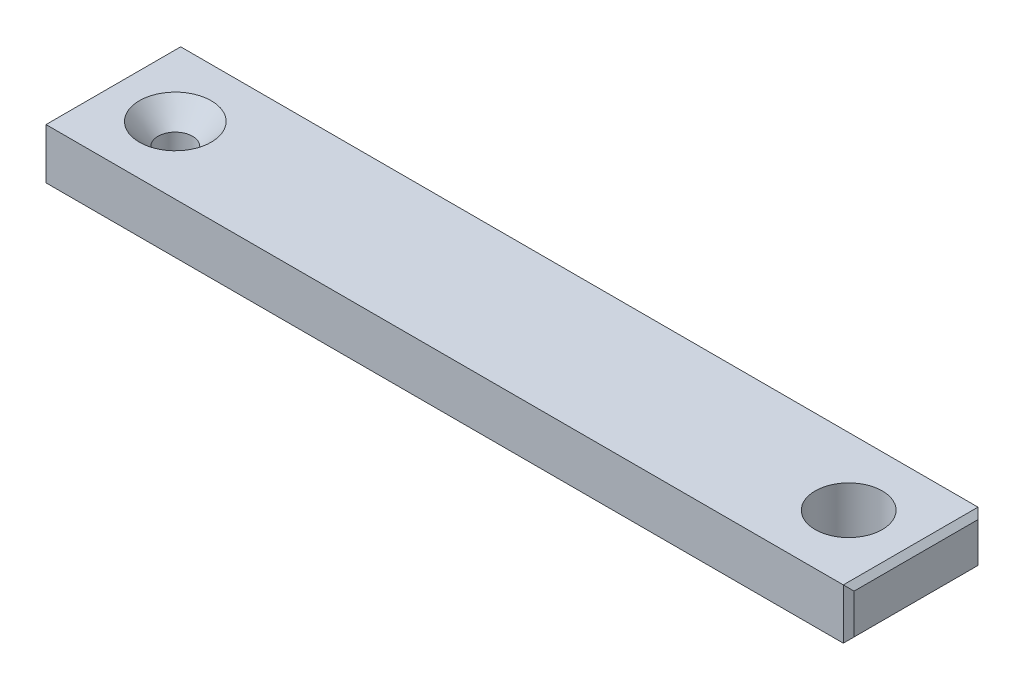
ISO-10303-21;
HEADER;
FILE_DESCRIPTION(('STEP AP214'),'2;1');
FILE_NAME('part.step','',(''),(''),'','','');
FILE_SCHEMA(('AUTOMOTIVE_DESIGN { 1 0 10303 214 1 1 1 1 }'));
ENDSEC;
DATA;
#1=APPLICATION_CONTEXT('core data for automotive mechanical design processes');
#2=APPLICATION_PROTOCOL_DEFINITION('international standard','automotive_design',2000,#1);
#3=PRODUCT_CONTEXT('',#1,'mechanical');
#4=PRODUCT('Part','Part','',(#3));
#5=PRODUCT_RELATED_PRODUCT_CATEGORY('part','',(#4));
#6=PRODUCT_DEFINITION_FORMATION('','',#4);
#7=PRODUCT_DEFINITION_CONTEXT('part definition',#1,'design');
#8=PRODUCT_DEFINITION('design','',#6,#7);
#9=PRODUCT_DEFINITION_SHAPE('','',#8);
#10=(LENGTH_UNIT() NAMED_UNIT(*) SI_UNIT(.MILLI.,.METRE.));
#11=(NAMED_UNIT(*) PLANE_ANGLE_UNIT() SI_UNIT($,.RADIAN.));
#12=(NAMED_UNIT(*) SI_UNIT($,.STERADIAN.) SOLID_ANGLE_UNIT());
#13=UNCERTAINTY_MEASURE_WITH_UNIT(LENGTH_MEASURE(1.E-05),#10,'distance_accuracy_value','');
#14=(GEOMETRIC_REPRESENTATION_CONTEXT(3) GLOBAL_UNCERTAINTY_ASSIGNED_CONTEXT((#13)) GLOBAL_UNIT_ASSIGNED_CONTEXT((#10,
#11,#12)) REPRESENTATION_CONTEXT('',''));
#15=CARTESIAN_POINT('',(0.,0.,0.));
#16=DIRECTION('',(0.,0.,1.));
#17=DIRECTION('',(1.,0.,0.));
#18=AXIS2_PLACEMENT_3D('',#15,#16,#17);
#19=CARTESIAN_POINT('',(0.,4.7625,6.35));
#20=DIRECTION('',(0.,0.,-1.));
#21=DIRECTION('',(-1.,0.,0.));
#22=AXIS2_PLACEMENT_3D('',#19,#20,#21);
#23=PLANE('',#22);
#24=DIRECTION('',(1.,0.,0.));
#25=VECTOR('',#24,1.);
#26=CARTESIAN_POINT('',(0.,4.7625,6.35));
#27=LINE('',#26,#25);
#28=CARTESIAN_POINT('',(-69.342,4.7625,6.35));
#29=VERTEX_POINT('',#28);
#30=CARTESIAN_POINT('',(5.84199999999999,4.7625,6.35));
#31=VERTEX_POINT('',#30);
#32=EDGE_CURVE('E182',#29,#31,#27,.T.);
#33=ORIENTED_EDGE('',*,*,#32,.F.);
#34=DIRECTION('',(0.,-1.,0.));
#35=VECTOR('',#34,1.);
#36=CARTESIAN_POINT('',(-69.342,4.7625,6.35));
#37=LINE('',#36,#35);
#38=CARTESIAN_POINT('',(-69.342,0.,6.35));
#39=VERTEX_POINT('',#38);
#40=EDGE_CURVE('E140',#29,#39,#37,.T.);
#41=ORIENTED_EDGE('',*,*,#40,.T.);
#42=DIRECTION('',(1.,0.,0.));
#43=VECTOR('',#42,1.);
#44=CARTESIAN_POINT('',(0.,0.,6.35));
#45=LINE('',#44,#43);
#46=CARTESIAN_POINT('',(5.84199999999999,0.,6.35));
#47=VERTEX_POINT('',#46);
#48=EDGE_CURVE('E183',#39,#47,#45,.T.);
#49=ORIENTED_EDGE('',*,*,#48,.T.);
#50=DIRECTION('',(0.,1.,0.));
#51=VECTOR('',#50,1.);
#52=CARTESIAN_POINT('',(5.84199999999999,4.7625,6.35));
#53=LINE('',#52,#51);
#54=EDGE_CURVE('E137',#47,#31,#53,.T.);
#55=ORIENTED_EDGE('',*,*,#54,.T.);
#56=EDGE_LOOP('',(#33,#41,#49,#55));
#57=FACE_BOUND('',#56,.T.);
#58=ADVANCED_FACE('F35',(#57),#23,.F.);
#59=CARTESIAN_POINT('',(6.34999999999999,4.7625,0.));
#60=DIRECTION('',(1.,0.,0.));
#61=DIRECTION('',(0.,0.,-1.));
#62=AXIS2_PLACEMENT_3D('',#59,#60,#61);
#63=PLANE('',#62);
#64=DIRECTION('',(0.,0.,1.));
#65=VECTOR('',#64,1.);
#66=CARTESIAN_POINT('',(6.34999999999999,4.25449999999999,0.));
#67=LINE('',#66,#65);
#68=CARTESIAN_POINT('',(6.34999999999999,4.25449999999999,-5.84199999999999));
#69=VERTEX_POINT('',#68);
#70=CARTESIAN_POINT('',(6.34999999999999,4.25449999999999,5.84199999999999));
#71=VERTEX_POINT('',#70);
#72=EDGE_CURVE('E44',#69,#71,#67,.T.);
#73=ORIENTED_EDGE('',*,*,#72,.T.);
#74=DIRECTION('',(0.,-1.,0.));
#75=VECTOR('',#74,1.);
#76=CARTESIAN_POINT('',(6.34999999999999,0.,5.84199999999999));
#77=LINE('',#76,#75);
#78=CARTESIAN_POINT('',(6.34999999999999,0.508000000000008,5.84199999999999));
#79=VERTEX_POINT('',#78);
#80=EDGE_CURVE('E11',#71,#79,#77,.T.);
#81=ORIENTED_EDGE('',*,*,#80,.T.);
#82=DIRECTION('',(0.,0.,-1.));
#83=VECTOR('',#82,1.);
#84=CARTESIAN_POINT('',(6.34999999999999,0.508000000000008,-6.35));
#85=LINE('',#84,#83);
#86=CARTESIAN_POINT('',(6.34999999999999,0.508000000000008,-5.84199999999999));
#87=VERTEX_POINT('',#86);
#88=EDGE_CURVE('E146',#79,#87,#85,.T.);
#89=ORIENTED_EDGE('',*,*,#88,.T.);
#90=DIRECTION('',(0.,1.,0.));
#91=VECTOR('',#90,1.);
#92=CARTESIAN_POINT('',(6.34999999999999,4.7625,-5.84199999999999));
#93=LINE('',#92,#91);
#94=EDGE_CURVE('E55',#87,#69,#93,.T.);
#95=ORIENTED_EDGE('',*,*,#94,.T.);
#96=EDGE_LOOP('',(#73,#81,#89,#95));
#97=FACE_BOUND('',#96,.T.);
#98=ADVANCED_FACE('F240',(#97),#63,.T.);
#99=CARTESIAN_POINT('',(0.,4.7625,-6.35));
#100=DIRECTION('',(0.,0.,-1.));
#101=DIRECTION('',(-1.,0.,0.));
#102=AXIS2_PLACEMENT_3D('',#99,#100,#101);
#103=PLANE('',#102);
#104=DIRECTION('',(1.,0.,0.));
#105=VECTOR('',#104,1.);
#106=CARTESIAN_POINT('',(0.,0.,-6.35));
#107=LINE('',#106,#105);
#108=CARTESIAN_POINT('',(-69.342,0.,-6.35));
#109=VERTEX_POINT('',#108);
#110=CARTESIAN_POINT('',(5.84199999999999,0.,-6.35));
#111=VERTEX_POINT('',#110);
#112=EDGE_CURVE('E176',#109,#111,#107,.T.);
#113=ORIENTED_EDGE('',*,*,#112,.F.);
#114=DIRECTION('',(0.,1.,0.));
#115=VECTOR('',#114,1.);
#116=CARTESIAN_POINT('',(-69.342,4.7625,-6.35));
#117=LINE('',#116,#115);
#118=CARTESIAN_POINT('',(-69.342,4.7625,-6.35));
#119=VERTEX_POINT('',#118);
#120=EDGE_CURVE('E107',#109,#119,#117,.T.);
#121=ORIENTED_EDGE('',*,*,#120,.T.);
#122=DIRECTION('',(1.,0.,0.));
#123=VECTOR('',#122,1.);
#124=CARTESIAN_POINT('',(0.,4.7625,-6.35));
#125=LINE('',#124,#123);
#126=CARTESIAN_POINT('',(5.84199999999999,4.7625,-6.35));
#127=VERTEX_POINT('',#126);
#128=EDGE_CURVE('E120',#119,#127,#125,.T.);
#129=ORIENTED_EDGE('',*,*,#128,.T.);
#130=DIRECTION('',(0.,-1.,0.));
#131=VECTOR('',#130,1.);
#132=CARTESIAN_POINT('',(5.84199999999999,4.7625,-6.35));
#133=LINE('',#132,#131);
#134=EDGE_CURVE('E126',#127,#111,#133,.T.);
#135=ORIENTED_EDGE('',*,*,#134,.T.);
#136=EDGE_LOOP('',(#113,#121,#129,#135));
#137=FACE_BOUND('',#136,.T.);
#138=ADVANCED_FACE('F175',(#137),#103,.T.);
#139=CARTESIAN_POINT('',(-69.85,4.7625,0.));
#140=DIRECTION('',(1.,0.,0.));
#141=DIRECTION('',(0.,0.,-1.));
#142=AXIS2_PLACEMENT_3D('',#139,#140,#141);
#143=PLANE('',#142);
#144=DIRECTION('',(0.,0.,-1.));
#145=VECTOR('',#144,1.);
#146=CARTESIAN_POINT('',(-69.85,4.25450000000001,-6.35));
#147=LINE('',#146,#145);
#148=CARTESIAN_POINT('',(-69.85,4.25450000000001,5.84200000000001));
#149=VERTEX_POINT('',#148);
#150=CARTESIAN_POINT('',(-69.85,4.25450000000001,-5.84200000000001));
#151=VERTEX_POINT('',#150);
#152=EDGE_CURVE('E124',#149,#151,#147,.T.);
#153=ORIENTED_EDGE('',*,*,#152,.T.);
#154=DIRECTION('',(0.,-1.,0.));
#155=VECTOR('',#154,1.);
#156=CARTESIAN_POINT('',(-69.85,0.,-5.84200000000001));
#157=LINE('',#156,#155);
#158=CARTESIAN_POINT('',(-69.85,0.507999999999995,-5.84200000000001));
#159=VERTEX_POINT('',#158);
#160=EDGE_CURVE('E105',#151,#159,#157,.T.);
#161=ORIENTED_EDGE('',*,*,#160,.T.);
#162=DIRECTION('',(0.,0.,1.));
#163=VECTOR('',#162,1.);
#164=CARTESIAN_POINT('',(-69.85,0.507999999999995,0.));
#165=LINE('',#164,#163);
#166=CARTESIAN_POINT('',(-69.85,0.507999999999995,5.84200000000001));
#167=VERTEX_POINT('',#166);
#168=EDGE_CURVE('E113',#159,#167,#165,.T.);
#169=ORIENTED_EDGE('',*,*,#168,.T.);
#170=DIRECTION('',(0.,1.,0.));
#171=VECTOR('',#170,1.);
#172=CARTESIAN_POINT('',(-69.85,4.7625,5.84200000000001));
#173=LINE('',#172,#171);
#174=EDGE_CURVE('E119',#167,#149,#173,.T.);
#175=ORIENTED_EDGE('',*,*,#174,.T.);
#176=EDGE_LOOP('',(#153,#161,#169,#175));
#177=FACE_BOUND('',#176,.T.);
#178=ADVANCED_FACE('F122',(#177),#143,.F.);
#179=CARTESIAN_POINT('',(0.,4.7625,0.));
#180=DIRECTION('',(0.,1.,0.));
#181=DIRECTION('',(0.,0.,1.));
#182=AXIS2_PLACEMENT_3D('',#179,#180,#181);
#183=PLANE('',#182);
#184=CARTESIAN_POINT('',(0.,4.7625,0.));
#185=DIRECTION('',(0.,1.,0.));
#186=DIRECTION('',(0.,0.,1.));
#187=AXIS2_PLACEMENT_3D('',#184,#185,#186);
#188=CIRCLE('',#187,3.1623);
#189=CARTESIAN_POINT('',(0.,4.7625,3.1623));
#190=VERTEX_POINT('',#189);
#191=EDGE_CURVE('E155',#190,#190,#188,.T.);
#192=ORIENTED_EDGE('',*,*,#191,.F.);
#193=EDGE_LOOP('',(#192));
#194=FACE_BOUND('',#193,.T.);
#195=CARTESIAN_POINT('',(-63.5,4.7625,0.));
#196=DIRECTION('',(0.,1.,0.));
#197=DIRECTION('',(0.,0.,1.));
#198=AXIS2_PLACEMENT_3D('',#195,#196,#197);
#199=CIRCLE('',#198,3.3909);
#200=CARTESIAN_POINT('',(-63.5,4.7625,3.3909));
#201=VERTEX_POINT('',#200);
#202=EDGE_CURVE('E206',#201,#201,#199,.T.);
#203=ORIENTED_EDGE('',*,*,#202,.F.);
#204=EDGE_LOOP('',(#203));
#205=FACE_BOUND('',#204,.T.);
#206=ORIENTED_EDGE('',*,*,#128,.F.);
#207=DIRECTION('',(0.,0.,1.));
#208=VECTOR('',#207,1.);
#209=CARTESIAN_POINT('',(-69.342,4.7625,6.35));
#210=LINE('',#209,#208);
#211=EDGE_CURVE('E135',#119,#29,#210,.T.);
#212=ORIENTED_EDGE('',*,*,#211,.T.);
#213=ORIENTED_EDGE('',*,*,#32,.T.);
#214=DIRECTION('',(0.,0.,-1.));
#215=VECTOR('',#214,1.);
#216=CARTESIAN_POINT('',(5.84199999999999,4.7625,0.));
#217=LINE('',#216,#215);
#218=EDGE_CURVE('E133',#31,#127,#217,.T.);
#219=ORIENTED_EDGE('',*,*,#218,.T.);
#220=EDGE_LOOP('',(#206,#212,#213,#219));
#221=FACE_BOUND('',#220,.T.);
#222=ADVANCED_FACE('F199',(#194,#205,#221),#183,.T.);
#223=CARTESIAN_POINT('',(0.,0.,0.));
#224=DIRECTION('',(0.,1.,0.));
#225=DIRECTION('',(0.,0.,1.));
#226=AXIS2_PLACEMENT_3D('',#223,#224,#225);
#227=PLANE('',#226);
#228=CARTESIAN_POINT('',(0.,0.,0.));
#229=DIRECTION('',(0.,1.,0.));
#230=DIRECTION('',(0.,0.,1.));
#231=AXIS2_PLACEMENT_3D('',#228,#229,#230);
#232=CIRCLE('',#231,3.1623);
#233=CARTESIAN_POINT('',(0.,0.,3.1623));
#234=VERTEX_POINT('',#233);
#235=EDGE_CURVE('E209',#234,#234,#232,.T.);
#236=ORIENTED_EDGE('',*,*,#235,.T.);
#237=EDGE_LOOP('',(#236));
#238=FACE_BOUND('',#237,.T.);
#239=CARTESIAN_POINT('',(-63.5,0.,0.));
#240=DIRECTION('',(0.,1.,0.));
#241=DIRECTION('',(0.,0.,1.));
#242=AXIS2_PLACEMENT_3D('',#239,#240,#241);
#243=CIRCLE('',#242,1.63195);
#244=CARTESIAN_POINT('',(-63.5,0.,1.63195));
#245=VERTEX_POINT('',#244);
#246=EDGE_CURVE('E187',#245,#245,#243,.T.);
#247=ORIENTED_EDGE('',*,*,#246,.T.);
#248=EDGE_LOOP('',(#247));
#249=FACE_BOUND('',#248,.T.);
#250=ORIENTED_EDGE('',*,*,#48,.F.);
#251=DIRECTION('',(0.,0.,-1.));
#252=VECTOR('',#251,1.);
#253=CARTESIAN_POINT('',(-69.342,0.,0.));
#254=LINE('',#253,#252);
#255=EDGE_CURVE('E144',#39,#109,#254,.T.);
#256=ORIENTED_EDGE('',*,*,#255,.T.);
#257=ORIENTED_EDGE('',*,*,#112,.T.);
#258=DIRECTION('',(0.,0.,1.));
#259=VECTOR('',#258,1.);
#260=CARTESIAN_POINT('',(5.84199999999999,0.,6.35));
#261=LINE('',#260,#259);
#262=EDGE_CURVE('E142',#111,#47,#261,.T.);
#263=ORIENTED_EDGE('',*,*,#262,.T.);
#264=EDGE_LOOP('',(#250,#256,#257,#263));
#265=FACE_BOUND('',#264,.T.);
#266=ADVANCED_FACE('F180',(#238,#249,#265),#227,.F.);
#267=CARTESIAN_POINT('',(-63.5,4.7625,0.));
#268=DIRECTION('',(0.,1.,0.));
#269=DIRECTION('',(0.,0.,1.));
#270=AXIS2_PLACEMENT_3D('',#267,#268,#269);
#271=CYLINDRICAL_SURFACE('',#270,1.63195);
#272=ORIENTED_EDGE('',*,*,#246,.F.);
#273=EDGE_LOOP('',(#272));
#274=FACE_BOUND('',#273,.T.);
#275=CARTESIAN_POINT('',(-63.5,2.73905949011861,0.));
#276=DIRECTION('',(0.,1.,0.));
#277=DIRECTION('',(0.,0.,1.));
#278=AXIS2_PLACEMENT_3D('',#275,#276,#277);
#279=CIRCLE('',#278,1.63195);
#280=CARTESIAN_POINT('',(-63.5,2.73905949011861,1.63195));
#281=VERTEX_POINT('',#280);
#282=EDGE_CURVE('E203',#281,#281,#279,.T.);
#283=ORIENTED_EDGE('',*,*,#282,.T.);
#284=EDGE_LOOP('',(#283));
#285=FACE_BOUND('',#284,.T.);
#286=ADVANCED_FACE('F230',(#274,#285),#271,.F.);
#287=CARTESIAN_POINT('',(-63.5,4.7625,0.));
#288=DIRECTION('',(0.,1.,0.));
#289=DIRECTION('',(0.,0.,1.));
#290=AXIS2_PLACEMENT_3D('',#287,#288,#289);
#291=CONICAL_SURFACE('',#290,3.3909,0.715584993317676);
#292=ORIENTED_EDGE('',*,*,#282,.F.);
#293=EDGE_LOOP('',(#292));
#294=FACE_BOUND('',#293,.T.);
#295=ORIENTED_EDGE('',*,*,#202,.T.);
#296=EDGE_LOOP('',(#295));
#297=FACE_BOUND('',#296,.T.);
#298=ADVANCED_FACE('F220',(#294,#297),#291,.F.);
#299=CARTESIAN_POINT('',(0.,0.,0.));
#300=DIRECTION('',(0.,1.,0.));
#301=DIRECTION('',(0.,0.,1.));
#302=AXIS2_PLACEMENT_3D('',#299,#300,#301);
#303=CYLINDRICAL_SURFACE('',#302,3.1623);
#304=ORIENTED_EDGE('',*,*,#235,.F.);
#305=EDGE_LOOP('',(#304));
#306=FACE_BOUND('',#305,.T.);
#307=ORIENTED_EDGE('',*,*,#191,.T.);
#308=EDGE_LOOP('',(#307));
#309=FACE_BOUND('',#308,.T.);
#310=ADVANCED_FACE('F217',(#306,#309),#303,.F.);
#311=CARTESIAN_POINT('',(-69.342,4.7625,6.35));
#312=DIRECTION('',(0.707106781186538,0.,-0.707106781186557));
#313=DIRECTION('',(0.,-1.,0.));
#314=AXIS2_PLACEMENT_3D('',#311,#312,#313);
#315=PLANE('',#314);
#316=DIRECTION('',(-0.577350269189631,0.577350269189631,-0.577350269189616));
#317=VECTOR('',#316,1.);
#318=CARTESIAN_POINT('',(-71.7973333333333,2.45533333333331,3.89466666666674));
#319=LINE('',#318,#317);
#320=EDGE_CURVE('E116',#39,#167,#319,.T.);
#321=ORIENTED_EDGE('',*,*,#320,.F.);
#322=ORIENTED_EDGE('',*,*,#40,.F.);
#323=DIRECTION('',(0.577350269189631,0.577350269189631,0.577350269189616));
#324=VECTOR('',#323,1.);
#325=CARTESIAN_POINT('',(-69.342,4.76250000000001,6.35));
#326=LINE('',#325,#324);
#327=EDGE_CURVE('E152',#149,#29,#326,.T.);
#328=ORIENTED_EDGE('',*,*,#327,.F.);
#329=ORIENTED_EDGE('',*,*,#174,.F.);
#330=EDGE_LOOP('',(#321,#322,#328,#329));
#331=FACE_BOUND('',#330,.T.);
#332=ADVANCED_FACE('F193',(#331),#315,.F.);
#333=CARTESIAN_POINT('',(-69.342,4.7625,0.));
#334=DIRECTION('',(-0.707106781186548,0.707106781186548,0.));
#335=DIRECTION('',(0.,0.,-1.));
#336=AXIS2_PLACEMENT_3D('',#333,#334,#335);
#337=PLANE('',#336);
#338=ORIENTED_EDGE('',*,*,#327,.T.);
#339=ORIENTED_EDGE('',*,*,#211,.F.);
#340=DIRECTION('',(-0.577350269189631,-0.577350269189631,0.577350269189616));
#341=VECTOR('',#340,1.);
#342=CARTESIAN_POINT('',(-71.4586666666667,2.64583333333336,-4.2333333333334));
#343=LINE('',#342,#341);
#344=EDGE_CURVE('E110',#151,#119,#343,.F.);
#345=ORIENTED_EDGE('',*,*,#344,.F.);
#346=ORIENTED_EDGE('',*,*,#152,.F.);
#347=EDGE_LOOP('',(#338,#339,#345,#346));
#348=FACE_BOUND('',#347,.T.);
#349=ADVANCED_FACE('F196',(#348),#337,.T.);
#350=CARTESIAN_POINT('',(-69.85,0.507999999999995,0.));
#351=DIRECTION('',(0.707106781186548,0.707106781186548,0.));
#352=DIRECTION('',(0.,0.,1.));
#353=AXIS2_PLACEMENT_3D('',#350,#351,#352);
#354=PLANE('',#353);
#355=ORIENTED_EDGE('',*,*,#320,.T.);
#356=ORIENTED_EDGE('',*,*,#168,.F.);
#357=DIRECTION('',(-0.577350269189631,0.577350269189631,0.577350269189616));
#358=VECTOR('',#357,1.);
#359=CARTESIAN_POINT('',(-71.7973333333333,2.45533333333331,-3.89466666666674));
#360=LINE('',#359,#358);
#361=EDGE_CURVE('E101',#109,#159,#360,.T.);
#362=ORIENTED_EDGE('',*,*,#361,.F.);
#363=ORIENTED_EDGE('',*,*,#255,.F.);
#364=EDGE_LOOP('',(#355,#356,#362,#363));
#365=FACE_BOUND('',#364,.T.);
#366=ADVANCED_FACE('F114',(#365),#354,.F.);
#367=CARTESIAN_POINT('',(-69.85,4.7625,-5.84200000000001));
#368=DIRECTION('',(-0.707106781186538,0.,-0.707106781186557));
#369=DIRECTION('',(0.,1.,0.));
#370=AXIS2_PLACEMENT_3D('',#367,#368,#369);
#371=PLANE('',#370);
#372=ORIENTED_EDGE('',*,*,#344,.T.);
#373=ORIENTED_EDGE('',*,*,#120,.F.);
#374=ORIENTED_EDGE('',*,*,#361,.T.);
#375=ORIENTED_EDGE('',*,*,#160,.F.);
#376=EDGE_LOOP('',(#372,#373,#374,#375));
#377=FACE_BOUND('',#376,.T.);
#378=ADVANCED_FACE('F103',(#377),#371,.T.);
#379=CARTESIAN_POINT('',(5.84199999999999,4.7625,-6.35));
#380=DIRECTION('',(-0.707106781186552,0.,0.707106781186543));
#381=DIRECTION('',(0.,-1.,0.));
#382=AXIS2_PLACEMENT_3D('',#379,#380,#381);
#383=PLANE('',#382);
#384=DIRECTION('',(-0.577350269189621,-0.577350269189628,-0.577350269189628));
#385=VECTOR('',#384,1.);
#386=CARTESIAN_POINT('',(7.95866666666665,2.11666666666669,-4.23333333333331));
#387=LINE('',#386,#385);
#388=EDGE_CURVE('E159',#111,#87,#387,.F.);
#389=ORIENTED_EDGE('',*,*,#388,.F.);
#390=ORIENTED_EDGE('',*,*,#134,.F.);
#391=DIRECTION('',(0.577350269189621,-0.577350269189628,0.577350269189628));
#392=VECTOR('',#391,1.);
#393=CARTESIAN_POINT('',(5.84199999999999,4.7625,-6.35));
#394=LINE('',#393,#392);
#395=EDGE_CURVE('E39',#69,#127,#394,.F.);
#396=ORIENTED_EDGE('',*,*,#395,.F.);
#397=ORIENTED_EDGE('',*,*,#94,.F.);
#398=EDGE_LOOP('',(#389,#390,#396,#397));
#399=FACE_BOUND('',#398,.T.);
#400=ADVANCED_FACE('F37',(#399),#383,.F.);
#401=CARTESIAN_POINT('',(6.34999999999999,4.25449999999999,0.));
#402=DIRECTION('',(-0.707106781186552,-0.707106781186543,0.));
#403=DIRECTION('',(0.,0.,1.));
#404=AXIS2_PLACEMENT_3D('',#401,#402,#403);
#405=PLANE('',#404);
#406=ORIENTED_EDGE('',*,*,#395,.T.);
#407=ORIENTED_EDGE('',*,*,#218,.F.);
#408=DIRECTION('',(-0.577350269189621,0.577350269189628,0.577350269189628));
#409=VECTOR('',#408,1.);
#410=CARTESIAN_POINT('',(8.29733333333332,2.30716666666664,3.89466666666664));
#411=LINE('',#410,#409);
#412=EDGE_CURVE('E158',#71,#31,#411,.T.);
#413=ORIENTED_EDGE('',*,*,#412,.F.);
#414=ORIENTED_EDGE('',*,*,#72,.F.);
#415=EDGE_LOOP('',(#406,#407,#413,#414));
#416=FACE_BOUND('',#415,.T.);
#417=ADVANCED_FACE('F168',(#416),#405,.F.);
#418=CARTESIAN_POINT('',(5.84199999999999,0.,0.));
#419=DIRECTION('',(0.707106781186552,-0.707106781186543,0.));
#420=DIRECTION('',(0.,0.,-1.));
#421=AXIS2_PLACEMENT_3D('',#418,#419,#420);
#422=PLANE('',#421);
#423=ORIENTED_EDGE('',*,*,#388,.T.);
#424=ORIENTED_EDGE('',*,*,#88,.F.);
#425=DIRECTION('',(-0.577350269189621,-0.577350269189628,0.577350269189628));
#426=VECTOR('',#425,1.);
#427=CARTESIAN_POINT('',(7.95866666666665,2.11666666666669,4.23333333333331));
#428=LINE('',#427,#426);
#429=EDGE_CURVE('E156',#47,#79,#428,.F.);
#430=ORIENTED_EDGE('',*,*,#429,.F.);
#431=ORIENTED_EDGE('',*,*,#262,.F.);
#432=EDGE_LOOP('',(#423,#424,#430,#431));
#433=FACE_BOUND('',#432,.T.);
#434=ADVANCED_FACE('F260',(#433),#422,.T.);
#435=CARTESIAN_POINT('',(6.34999999999999,4.7625,5.84199999999999));
#436=DIRECTION('',(0.707106781186552,0.,0.707106781186543));
#437=DIRECTION('',(0.,1.,0.));
#438=AXIS2_PLACEMENT_3D('',#435,#436,#437);
#439=PLANE('',#438);
#440=ORIENTED_EDGE('',*,*,#412,.T.);
#441=ORIENTED_EDGE('',*,*,#54,.F.);
#442=ORIENTED_EDGE('',*,*,#429,.T.);
#443=ORIENTED_EDGE('',*,*,#80,.F.);
#444=EDGE_LOOP('',(#440,#441,#442,#443));
#445=FACE_BOUND('',#444,.T.);
#446=ADVANCED_FACE('F257',(#445),#439,.T.);
#447=CLOSED_SHELL('',(#58,#98,#138,#178,#222,#266,#286,#298,#310,#332,#349,#366,#378,#400,#417,
#434,#446));
#448=MANIFOLD_SOLID_BREP('B2',#447);
#449=ADVANCED_BREP_SHAPE_REPRESENTATION('',(#18,#448),#14);
#450=SHAPE_DEFINITION_REPRESENTATION(#9,#449);
ENDSEC;
END-ISO-10303-21;
